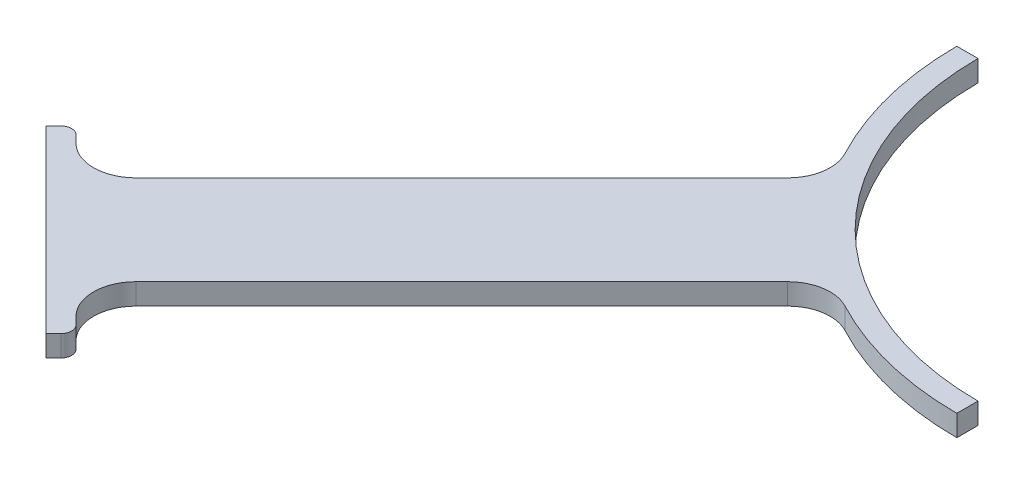
ISO-10303-21;
HEADER;
FILE_DESCRIPTION(('STEP AP214'),'2;1');
FILE_NAME('part.step','',(''),(''),'','','');
FILE_SCHEMA(('AUTOMOTIVE_DESIGN { 1 0 10303 214 1 1 1 1 }'));
ENDSEC;
DATA;
#1=APPLICATION_CONTEXT('core data for automotive mechanical design processes');
#2=APPLICATION_PROTOCOL_DEFINITION('international standard','automotive_design',2000,#1);
#3=PRODUCT_CONTEXT('',#1,'mechanical');
#4=PRODUCT('Part','Part','',(#3));
#5=PRODUCT_RELATED_PRODUCT_CATEGORY('part','',(#4));
#6=PRODUCT_DEFINITION_FORMATION('','',#4);
#7=PRODUCT_DEFINITION_CONTEXT('part definition',#1,'design');
#8=PRODUCT_DEFINITION('design','',#6,#7);
#9=PRODUCT_DEFINITION_SHAPE('','',#8);
#10=(LENGTH_UNIT() NAMED_UNIT(*) SI_UNIT(.MILLI.,.METRE.));
#11=(NAMED_UNIT(*) PLANE_ANGLE_UNIT() SI_UNIT($,.RADIAN.));
#12=(NAMED_UNIT(*) SI_UNIT($,.STERADIAN.) SOLID_ANGLE_UNIT());
#13=UNCERTAINTY_MEASURE_WITH_UNIT(LENGTH_MEASURE(1.E-05),#10,'distance_accuracy_value','');
#14=(GEOMETRIC_REPRESENTATION_CONTEXT(3) GLOBAL_UNCERTAINTY_ASSIGNED_CONTEXT((#13)) GLOBAL_UNIT_ASSIGNED_CONTEXT((#10,
#11,#12)) REPRESENTATION_CONTEXT('',''));
#15=CARTESIAN_POINT('',(0.,0.,0.));
#16=DIRECTION('',(0.,0.,1.));
#17=DIRECTION('',(1.,0.,0.));
#18=AXIS2_PLACEMENT_3D('',#15,#16,#17);
#19=CARTESIAN_POINT('',(0.,5.,0.));
#20=DIRECTION('',(0.,0.,1.));
#21=DIRECTION('',(1.,0.,0.));
#22=AXIS2_PLACEMENT_3D('',#19,#20,#21);
#23=PLANE('',#22);
#24=DIRECTION('',(-1.,0.,0.));
#25=VECTOR('',#24,1.);
#26=CARTESIAN_POINT('',(0.,0.,0.));
#27=LINE('',#26,#25);
#28=CARTESIAN_POINT('',(-70.,0.,0.));
#29=VERTEX_POINT('',#28);
#30=CARTESIAN_POINT('',(-75.,0.,0.));
#31=VERTEX_POINT('',#30);
#32=EDGE_CURVE('E202',#29,#31,#27,.T.);
#33=ORIENTED_EDGE('',*,*,#32,.T.);
#34=DIRECTION('',(0.,-1.,0.));
#35=VECTOR('',#34,1.);
#36=CARTESIAN_POINT('',(-75.,5.,0.));
#37=LINE('',#36,#35);
#38=CARTESIAN_POINT('',(-75.,5.,0.));
#39=VERTEX_POINT('',#38);
#40=EDGE_CURVE('E180',#39,#31,#37,.T.);
#41=ORIENTED_EDGE('',*,*,#40,.F.);
#42=DIRECTION('',(-1.,0.,0.));
#43=VECTOR('',#42,1.);
#44=CARTESIAN_POINT('',(0.,5.,0.));
#45=LINE('',#44,#43);
#46=CARTESIAN_POINT('',(-70.,5.,0.));
#47=VERTEX_POINT('',#46);
#48=EDGE_CURVE('E187',#47,#39,#45,.T.);
#49=ORIENTED_EDGE('',*,*,#48,.F.);
#50=DIRECTION('',(0.,-1.,0.));
#51=VECTOR('',#50,1.);
#52=CARTESIAN_POINT('',(-70.,5.,0.));
#53=LINE('',#52,#51);
#54=EDGE_CURVE('E331',#47,#29,#53,.T.);
#55=ORIENTED_EDGE('',*,*,#54,.T.);
#56=EDGE_LOOP('',(#33,#41,#49,#55));
#57=FACE_BOUND('',#56,.T.);
#58=ADVANCED_FACE('F49',(#57),#23,.F.);
#59=CARTESIAN_POINT('',(0.,5.,0.));
#60=DIRECTION('',(0.,-1.,0.));
#61=DIRECTION('',(0.,0.,-1.));
#62=AXIS2_PLACEMENT_3D('',#59,#60,#61);
#63=CYLINDRICAL_SURFACE('',#62,75.);
#64=CARTESIAN_POINT('',(0.,0.,0.));
#65=DIRECTION('',(0.,1.,0.));
#66=DIRECTION('',(0.,0.,1.));
#67=AXIS2_PLACEMENT_3D('',#64,#65,#66);
#68=CIRCLE('',#67,75.);
#69=CARTESIAN_POINT('',(-66.2852611720978,0.,35.0893737668084));
#70=VERTEX_POINT('',#69);
#71=EDGE_CURVE('E380',#31,#70,#68,.T.);
#72=ORIENTED_EDGE('',*,*,#71,.T.);
#73=DIRECTION('',(0.,-1.,0.));
#74=VECTOR('',#73,1.);
#75=CARTESIAN_POINT('',(-66.2852611720978,5.,35.0893737668084));
#76=LINE('',#75,#74);
#77=CARTESIAN_POINT('',(-66.2852611720978,5.,35.0893737668084));
#78=VERTEX_POINT('',#77);
#79=EDGE_CURVE('E183',#70,#78,#76,.F.);
#80=ORIENTED_EDGE('',*,*,#79,.T.);
#81=CARTESIAN_POINT('',(0.,5.,0.));
#82=DIRECTION('',(0.,1.,0.));
#83=DIRECTION('',(0.,0.,1.));
#84=AXIS2_PLACEMENT_3D('',#81,#82,#83);
#85=CIRCLE('',#84,75.);
#86=EDGE_CURVE('E175',#39,#78,#85,.T.);
#87=ORIENTED_EDGE('',*,*,#86,.F.);
#88=ORIENTED_EDGE('',*,*,#40,.T.);
#89=EDGE_LOOP('',(#72,#80,#87,#88));
#90=FACE_BOUND('',#89,.T.);
#91=ADVANCED_FACE('F178',(#90),#63,.T.);
#92=CARTESIAN_POINT('',(-10.6066017177988,5.,-10.6066017177987));
#93=DIRECTION('',(-0.70710678118655,0.,-0.707106781186545));
#94=DIRECTION('',(-0.707106781186545,0.,0.70710678118655));
#95=AXIS2_PLACEMENT_3D('',#92,#93,#94);
#96=PLANE('',#95);
#97=DIRECTION('',(0.707106781186545,0.,-0.70710678118655));
#98=VECTOR('',#97,1.);
#99=CARTESIAN_POINT('',(-10.6066017177988,0.,-10.6066017177987));
#100=LINE('',#99,#98);
#101=CARTESIAN_POINT('',(-144.956890143242,0.,123.743686707646));
#102=VERTEX_POINT('',#101);
#103=CARTESIAN_POINT('',(-68.0522281831787,0.,46.8390247475817));
#104=VERTEX_POINT('',#103);
#105=EDGE_CURVE('E309',#102,#104,#100,.T.);
#106=ORIENTED_EDGE('',*,*,#105,.F.);
#107=DIRECTION('',(0.,-1.,0.));
#108=VECTOR('',#107,1.);
#109=CARTESIAN_POINT('',(-144.956890143242,5.,123.743686707646));
#110=LINE('',#109,#108);
#111=CARTESIAN_POINT('',(-144.956890143242,5.,123.743686707646));
#112=VERTEX_POINT('',#111);
#113=EDGE_CURVE('E232',#102,#112,#110,.F.);
#114=ORIENTED_EDGE('',*,*,#113,.T.);
#115=DIRECTION('',(0.707106781186545,0.,-0.70710678118655));
#116=VECTOR('',#115,1.);
#117=CARTESIAN_POINT('',(-10.6066017177988,5.,-10.6066017177987));
#118=LINE('',#117,#116);
#119=CARTESIAN_POINT('',(-68.0522281831787,5.,46.8390247475817));
#120=VERTEX_POINT('',#119);
#121=EDGE_CURVE('E186',#112,#120,#118,.T.);
#122=ORIENTED_EDGE('',*,*,#121,.T.);
#123=DIRECTION('',(0.,-1.,0.));
#124=VECTOR('',#123,1.);
#125=CARTESIAN_POINT('',(-68.0522281831787,5.,46.8390247475817));
#126=LINE('',#125,#124);
#127=EDGE_CURVE('E229',#120,#104,#126,.T.);
#128=ORIENTED_EDGE('',*,*,#127,.T.);
#129=EDGE_LOOP('',(#106,#114,#122,#128));
#130=FACE_BOUND('',#129,.T.);
#131=ADVANCED_FACE('F389',(#130),#96,.T.);
#132=CARTESIAN_POINT('',(-141.421356237309,5.,141.42135623731));
#133=DIRECTION('',(0.707106781186545,0.,-0.70710678118655));
#134=DIRECTION('',(-0.70710678118655,0.,-0.707106781186545));
#135=AXIS2_PLACEMENT_3D('',#132,#133,#134);
#136=PLANE('',#135);
#137=DIRECTION('',(0.70710678118655,0.,0.707106781186545));
#138=VECTOR('',#137,1.);
#139=CARTESIAN_POINT('',(-141.421356237309,0.,141.42135623731));
#140=LINE('',#139,#138);
#141=CARTESIAN_POINT('',(-160.866792719939,0.,121.975919754679));
#142=VERTEX_POINT('',#141);
#143=CARTESIAN_POINT('',(-159.099025766973,0.,123.743686707646));
#144=VERTEX_POINT('',#143);
#145=EDGE_CURVE('E303',#142,#144,#140,.T.);
#146=ORIENTED_EDGE('',*,*,#145,.F.);
#147=DIRECTION('',(0.,-1.,0.));
#148=VECTOR('',#147,1.);
#149=CARTESIAN_POINT('',(-160.866792719939,5.,121.975919754679));
#150=LINE('',#149,#148);
#151=CARTESIAN_POINT('',(-160.866792719939,5.,121.975919754679));
#152=VERTEX_POINT('',#151);
#153=EDGE_CURVE('E11',#142,#152,#150,.F.);
#154=ORIENTED_EDGE('',*,*,#153,.T.);
#155=DIRECTION('',(0.70710678118655,0.,0.707106781186545));
#156=VECTOR('',#155,1.);
#157=CARTESIAN_POINT('',(-141.421356237309,5.,141.42135623731));
#158=LINE('',#157,#156);
#159=CARTESIAN_POINT('',(-159.099025766973,5.,123.743686707646));
#160=VERTEX_POINT('',#159);
#161=EDGE_CURVE('E354',#152,#160,#158,.T.);
#162=ORIENTED_EDGE('',*,*,#161,.T.);
#163=DIRECTION('',(0.,-1.,0.));
#164=VECTOR('',#163,1.);
#165=CARTESIAN_POINT('',(-159.099025766973,0.,123.743686707646));
#166=LINE('',#165,#164);
#167=EDGE_CURVE('E225',#160,#144,#166,.T.);
#168=ORIENTED_EDGE('',*,*,#167,.T.);
#169=EDGE_LOOP('',(#146,#154,#162,#168));
#170=FACE_BOUND('',#169,.T.);
#171=ADVANCED_FACE('F556',(#170),#136,.T.);
#172=CARTESIAN_POINT('',(-21.2132034355967,5.,-21.2132034355966));
#173=DIRECTION('',(-0.707106781186549,0.,-0.707106781186546));
#174=DIRECTION('',(-0.707106781186546,0.,0.707106781186549));
#175=AXIS2_PLACEMENT_3D('',#172,#173,#174);
#176=PLANE('',#175);
#177=DIRECTION('',(0.707106781186546,0.,-0.707106781186549));
#178=VECTOR('',#177,1.);
#179=CARTESIAN_POINT('',(-21.2132034355967,5.,-21.2132034355966));
#180=LINE('',#179,#178);
#181=CARTESIAN_POINT('',(-166.170093578839,5.,123.743686707646));
#182=VERTEX_POINT('',#181);
#183=CARTESIAN_POINT('',(-164.402326625872,5.,121.975919754679));
#184=VERTEX_POINT('',#183);
#185=EDGE_CURVE('E294',#182,#184,#180,.T.);
#186=ORIENTED_EDGE('',*,*,#185,.T.);
#187=DIRECTION('',(0.,-1.,0.));
#188=VECTOR('',#187,1.);
#189=CARTESIAN_POINT('',(-164.402326625872,5.,121.975919754679));
#190=LINE('',#189,#188);
#191=CARTESIAN_POINT('',(-164.402326625872,0.,121.975919754679));
#192=VERTEX_POINT('',#191);
#193=EDGE_CURVE('E58',#184,#192,#190,.T.);
#194=ORIENTED_EDGE('',*,*,#193,.T.);
#195=DIRECTION('',(0.707106781186546,0.,-0.707106781186549));
#196=VECTOR('',#195,1.);
#197=CARTESIAN_POINT('',(-21.2132034355967,0.,-21.2132034355966));
#198=LINE('',#197,#196);
#199=CARTESIAN_POINT('',(-166.170093578839,0.,123.743686707646));
#200=VERTEX_POINT('',#199);
#201=EDGE_CURVE('E292',#200,#192,#198,.T.);
#202=ORIENTED_EDGE('',*,*,#201,.F.);
#203=DIRECTION('',(0.,-1.,0.));
#204=VECTOR('',#203,1.);
#205=CARTESIAN_POINT('',(-166.170093578839,5.,123.743686707646));
#206=LINE('',#205,#204);
#207=EDGE_CURVE('E205',#182,#200,#206,.T.);
#208=ORIENTED_EDGE('',*,*,#207,.F.);
#209=EDGE_LOOP('',(#186,#194,#202,#208));
#210=FACE_BOUND('',#209,.T.);
#211=ADVANCED_FACE('F291',(#210),#176,.T.);
#212=CARTESIAN_POINT('',(-144.956890143242,5.,144.956890143242));
#213=DIRECTION('',(-0.707106781186547,0.,0.707106781186548));
#214=DIRECTION('',(0.707106781186548,0.,0.707106781186547));
#215=AXIS2_PLACEMENT_3D('',#212,#213,#214);
#216=PLANE('',#215);
#217=DIRECTION('',(-0.707106781186548,0.,-0.707106781186547));
#218=VECTOR('',#217,1.);
#219=CARTESIAN_POINT('',(-144.956890143242,0.,144.956890143242));
#220=LINE('',#219,#218);
#221=CARTESIAN_POINT('',(-123.743686707646,0.,166.170093578839));
#222=VERTEX_POINT('',#221);
#223=EDGE_CURVE('E301',#222,#200,#220,.T.);
#224=ORIENTED_EDGE('',*,*,#223,.F.);
#225=DIRECTION('',(0.,-1.,0.));
#226=VECTOR('',#225,1.);
#227=CARTESIAN_POINT('',(-123.743686707646,5.,166.170093578839));
#228=LINE('',#227,#226);
#229=CARTESIAN_POINT('',(-123.743686707646,5.,166.170093578839));
#230=VERTEX_POINT('',#229);
#231=EDGE_CURVE('E214',#230,#222,#228,.T.);
#232=ORIENTED_EDGE('',*,*,#231,.F.);
#233=DIRECTION('',(-0.707106781186548,0.,-0.707106781186547));
#234=VECTOR('',#233,1.);
#235=CARTESIAN_POINT('',(-144.956890143242,5.,144.956890143242));
#236=LINE('',#235,#234);
#237=EDGE_CURVE('E353',#230,#182,#236,.T.);
#238=ORIENTED_EDGE('',*,*,#237,.T.);
#239=ORIENTED_EDGE('',*,*,#207,.T.);
#240=EDGE_LOOP('',(#224,#232,#238,#239));
#241=FACE_BOUND('',#240,.T.);
#242=ADVANCED_FACE('F352',(#241),#216,.T.);
#243=CARTESIAN_POINT('',(21.2132034355965,5.,21.2132034355965));
#244=DIRECTION('',(-0.707106781186548,0.,-0.707106781186548));
#245=DIRECTION('',(-0.707106781186548,0.,0.707106781186548));
#246=AXIS2_PLACEMENT_3D('',#243,#244,#245);
#247=PLANE('',#246);
#248=DIRECTION('',(0.707106781186548,0.,-0.707106781186548));
#249=VECTOR('',#248,1.);
#250=CARTESIAN_POINT('',(21.2132034355965,0.,21.2132034355965));
#251=LINE('',#250,#249);
#252=CARTESIAN_POINT('',(-121.975919754679,0.,164.402326625872));
#253=VERTEX_POINT('',#252);
#254=EDGE_CURVE('E307',#222,#253,#251,.T.);
#255=ORIENTED_EDGE('',*,*,#254,.T.);
#256=DIRECTION('',(0.,-1.,0.));
#257=VECTOR('',#256,1.);
#258=CARTESIAN_POINT('',(-121.975919754679,5.,164.402326625872));
#259=LINE('',#258,#257);
#260=CARTESIAN_POINT('',(-121.975919754679,5.,164.402326625872));
#261=VERTEX_POINT('',#260);
#262=EDGE_CURVE('E276',#253,#261,#259,.F.);
#263=ORIENTED_EDGE('',*,*,#262,.T.);
#264=DIRECTION('',(0.707106781186548,0.,-0.707106781186548));
#265=VECTOR('',#264,1.);
#266=CARTESIAN_POINT('',(21.2132034355965,5.,21.2132034355965));
#267=LINE('',#266,#265);
#268=EDGE_CURVE('E348',#230,#261,#267,.T.);
#269=ORIENTED_EDGE('',*,*,#268,.F.);
#270=ORIENTED_EDGE('',*,*,#231,.T.);
#271=EDGE_LOOP('',(#255,#263,#269,#270));
#272=FACE_BOUND('',#271,.T.);
#273=ADVANCED_FACE('F346',(#272),#247,.F.);
#274=CARTESIAN_POINT('',(-141.42135623731,5.,141.421356237309));
#275=DIRECTION('',(-0.707106781186549,0.,0.707106781186546));
#276=DIRECTION('',(0.707106781186546,0.,0.707106781186549));
#277=AXIS2_PLACEMENT_3D('',#274,#275,#276);
#278=PLANE('',#277);
#279=DIRECTION('',(-0.707106781186546,0.,-0.707106781186549));
#280=VECTOR('',#279,1.);
#281=CARTESIAN_POINT('',(-141.42135623731,5.,141.421356237309));
#282=LINE('',#281,#280);
#283=CARTESIAN_POINT('',(-121.975919754679,5.,160.86679271994));
#284=VERTEX_POINT('',#283);
#285=CARTESIAN_POINT('',(-123.743686707646,5.,159.099025766973));
#286=VERTEX_POINT('',#285);
#287=EDGE_CURVE('E365',#284,#286,#282,.T.);
#288=ORIENTED_EDGE('',*,*,#287,.F.);
#289=DIRECTION('',(0.,-1.,0.));
#290=VECTOR('',#289,1.);
#291=CARTESIAN_POINT('',(-121.975919754679,5.,160.86679271994));
#292=LINE('',#291,#290);
#293=CARTESIAN_POINT('',(-121.975919754679,0.,160.86679271994));
#294=VERTEX_POINT('',#293);
#295=EDGE_CURVE('E266',#284,#294,#292,.T.);
#296=ORIENTED_EDGE('',*,*,#295,.T.);
#297=DIRECTION('',(-0.707106781186546,0.,-0.707106781186549));
#298=VECTOR('',#297,1.);
#299=CARTESIAN_POINT('',(-141.42135623731,0.,141.421356237309));
#300=LINE('',#299,#298);
#301=CARTESIAN_POINT('',(-123.743686707646,0.,159.099025766973));
#302=VERTEX_POINT('',#301);
#303=EDGE_CURVE('E316',#294,#302,#300,.T.);
#304=ORIENTED_EDGE('',*,*,#303,.T.);
#305=DIRECTION('',(0.,-1.,0.));
#306=VECTOR('',#305,1.);
#307=CARTESIAN_POINT('',(-123.743686707646,5.,159.099025766973));
#308=LINE('',#307,#306);
#309=EDGE_CURVE('E221',#302,#286,#308,.F.);
#310=ORIENTED_EDGE('',*,*,#309,.T.);
#311=EDGE_LOOP('',(#288,#296,#304,#310));
#312=FACE_BOUND('',#311,.T.);
#313=ADVANCED_FACE('F496',(#312),#278,.F.);
#314=CARTESIAN_POINT('',(10.6066017177986,5.,10.6066017177986));
#315=DIRECTION('',(-0.707106781186546,0.,-0.707106781186549));
#316=DIRECTION('',(-0.707106781186549,0.,0.707106781186546));
#317=AXIS2_PLACEMENT_3D('',#314,#315,#316);
#318=PLANE('',#317);
#319=DIRECTION('',(0.707106781186549,0.,-0.707106781186546));
#320=VECTOR('',#319,1.);
#321=CARTESIAN_POINT('',(10.6066017177986,5.,10.6066017177986));
#322=LINE('',#321,#320);
#323=CARTESIAN_POINT('',(-123.743686707646,5.,144.956890143242));
#324=VERTEX_POINT('',#323);
#325=CARTESIAN_POINT('',(-46.8390247475818,5.,68.0522281831787));
#326=VERTEX_POINT('',#325);
#327=EDGE_CURVE('E368',#324,#326,#322,.T.);
#328=ORIENTED_EDGE('',*,*,#327,.F.);
#329=DIRECTION('',(0.,-1.,0.));
#330=VECTOR('',#329,1.);
#331=CARTESIAN_POINT('',(-123.743686707646,0.,144.956890143242));
#332=LINE('',#331,#330);
#333=CARTESIAN_POINT('',(-123.743686707646,0.,144.956890143242));
#334=VERTEX_POINT('',#333);
#335=EDGE_CURVE('E211',#324,#334,#332,.T.);
#336=ORIENTED_EDGE('',*,*,#335,.T.);
#337=DIRECTION('',(0.707106781186549,0.,-0.707106781186546));
#338=VECTOR('',#337,1.);
#339=CARTESIAN_POINT('',(10.6066017177986,0.,10.6066017177986));
#340=LINE('',#339,#338);
#341=CARTESIAN_POINT('',(-46.8390247475818,0.,68.0522281831787));
#342=VERTEX_POINT('',#341);
#343=EDGE_CURVE('E319',#334,#342,#340,.T.);
#344=ORIENTED_EDGE('',*,*,#343,.T.);
#345=DIRECTION('',(0.,1.,0.));
#346=VECTOR('',#345,1.);
#347=CARTESIAN_POINT('',(-46.8390247475818,5.,68.0522281831787));
#348=LINE('',#347,#346);
#349=EDGE_CURVE('E204',#342,#326,#348,.T.);
#350=ORIENTED_EDGE('',*,*,#349,.T.);
#351=EDGE_LOOP('',(#328,#336,#344,#350));
#352=FACE_BOUND('',#351,.T.);
#353=ADVANCED_FACE('F492',(#352),#318,.F.);
#354=CARTESIAN_POINT('',(-35.0893737668085,5.,66.2852611720978));
#355=VERTEX_POINT('',#354);
#356=CARTESIAN_POINT('',(0.,5.,75.));
#357=VERTEX_POINT('',#356);
#358=EDGE_CURVE('E189',#355,#357,#85,.T.);
#359=ORIENTED_EDGE('',*,*,#358,.F.);
#360=DIRECTION('',(0.,-1.,0.));
#361=VECTOR('',#360,1.);
#362=CARTESIAN_POINT('',(-35.0893737668085,5.,66.2852611720978));
#363=LINE('',#362,#361);
#364=CARTESIAN_POINT('',(-35.0893737668085,0.,66.2852611720978));
#365=VERTEX_POINT('',#364);
#366=EDGE_CURVE('E237',#355,#365,#363,.T.);
#367=ORIENTED_EDGE('',*,*,#366,.T.);
#368=CARTESIAN_POINT('',(0.,0.,75.));
#369=VERTEX_POINT('',#368);
#370=EDGE_CURVE('E323',#365,#369,#68,.T.);
#371=ORIENTED_EDGE('',*,*,#370,.T.);
#372=DIRECTION('',(0.,-1.,0.));
#373=VECTOR('',#372,1.);
#374=CARTESIAN_POINT('',(0.,5.,75.));
#375=LINE('',#374,#373);
#376=EDGE_CURVE('E337',#357,#369,#375,.T.);
#377=ORIENTED_EDGE('',*,*,#376,.F.);
#378=EDGE_LOOP('',(#359,#367,#371,#377));
#379=FACE_BOUND('',#378,.T.);
#380=ADVANCED_FACE('F452',(#379),#63,.T.);
#381=CARTESIAN_POINT('',(0.,5.,0.));
#382=DIRECTION('',(1.,0.,0.));
#383=DIRECTION('',(0.,0.,-1.));
#384=AXIS2_PLACEMENT_3D('',#381,#382,#383);
#385=PLANE('',#384);
#386=DIRECTION('',(0.,0.,1.));
#387=VECTOR('',#386,1.);
#388=CARTESIAN_POINT('',(0.,0.,0.));
#389=LINE('',#388,#387);
#390=CARTESIAN_POINT('',(0.,0.,70.));
#391=VERTEX_POINT('',#390);
#392=EDGE_CURVE('E324',#391,#369,#389,.T.);
#393=ORIENTED_EDGE('',*,*,#392,.F.);
#394=DIRECTION('',(0.,-1.,0.));
#395=VECTOR('',#394,1.);
#396=CARTESIAN_POINT('',(0.,5.,70.));
#397=LINE('',#396,#395);
#398=CARTESIAN_POINT('',(0.,5.,70.));
#399=VERTEX_POINT('',#398);
#400=EDGE_CURVE('E334',#399,#391,#397,.T.);
#401=ORIENTED_EDGE('',*,*,#400,.F.);
#402=DIRECTION('',(0.,0.,1.));
#403=VECTOR('',#402,1.);
#404=CARTESIAN_POINT('',(0.,5.,0.));
#405=LINE('',#404,#403);
#406=EDGE_CURVE('E372',#399,#357,#405,.T.);
#407=ORIENTED_EDGE('',*,*,#406,.T.);
#408=ORIENTED_EDGE('',*,*,#376,.T.);
#409=EDGE_LOOP('',(#393,#401,#407,#408));
#410=FACE_BOUND('',#409,.T.);
#411=ADVANCED_FACE('F456',(#410),#385,.T.);
#412=CARTESIAN_POINT('',(0.,5.,0.));
#413=DIRECTION('',(0.,-1.,0.));
#414=DIRECTION('',(0.,0.,-1.));
#415=AXIS2_PLACEMENT_3D('',#412,#413,#414);
#416=CYLINDRICAL_SURFACE('',#415,70.);
#417=CARTESIAN_POINT('',(0.,0.,0.));
#418=DIRECTION('',(0.,1.,0.));
#419=DIRECTION('',(0.,0.,1.));
#420=AXIS2_PLACEMENT_3D('',#417,#418,#419);
#421=CIRCLE('',#420,70.);
#422=EDGE_CURVE('E199',#29,#391,#421,.T.);
#423=ORIENTED_EDGE('',*,*,#422,.F.);
#424=ORIENTED_EDGE('',*,*,#54,.F.);
#425=CARTESIAN_POINT('',(0.,5.,0.));
#426=DIRECTION('',(0.,1.,0.));
#427=DIRECTION('',(0.,0.,1.));
#428=AXIS2_PLACEMENT_3D('',#425,#426,#427);
#429=CIRCLE('',#428,70.);
#430=EDGE_CURVE('E196',#47,#399,#429,.T.);
#431=ORIENTED_EDGE('',*,*,#430,.T.);
#432=ORIENTED_EDGE('',*,*,#400,.T.);
#433=EDGE_LOOP('',(#423,#424,#431,#432));
#434=FACE_BOUND('',#433,.T.);
#435=ADVANCED_FACE('F459',(#434),#416,.F.);
#436=CARTESIAN_POINT('',(0.,5.,0.));
#437=DIRECTION('',(0.,1.,0.));
#438=DIRECTION('',(0.,0.,1.));
#439=AXIS2_PLACEMENT_3D('',#436,#437,#438);
#440=PLANE('',#439);
#441=ORIENTED_EDGE('',*,*,#268,.T.);
#442=CARTESIAN_POINT('',(-123.743686707646,5.,162.634559672906));
#443=DIRECTION('',(0.,1.,0.));
#444=DIRECTION('',(0.,0.,1.));
#445=AXIS2_PLACEMENT_3D('',#442,#443,#444);
#446=CIRCLE('',#445,2.5);
#447=EDGE_CURVE('E281',#261,#284,#446,.T.);
#448=ORIENTED_EDGE('',*,*,#447,.T.);
#449=ORIENTED_EDGE('',*,*,#287,.T.);
#450=CARTESIAN_POINT('',(-116.67261889578,5.,152.027957955108));
#451=DIRECTION('',(0.,1.,0.));
#452=DIRECTION('',(0.,0.,1.));
#453=AXIS2_PLACEMENT_3D('',#450,#451,#452);
#454=CIRCLE('',#453,10.);
#455=EDGE_CURVE('E245',#286,#324,#454,.F.);
#456=ORIENTED_EDGE('',*,*,#455,.T.);
#457=ORIENTED_EDGE('',*,*,#327,.T.);
#458=CARTESIAN_POINT('',(-39.7679569357163,5.,75.1232959950442));
#459=DIRECTION('',(0.,1.,0.));
#460=DIRECTION('',(0.,0.,1.));
#461=AXIS2_PLACEMENT_3D('',#458,#459,#460);
#462=CIRCLE('',#461,10.);
#463=EDGE_CURVE('E263',#326,#355,#462,.F.);
#464=ORIENTED_EDGE('',*,*,#463,.T.);
#465=ORIENTED_EDGE('',*,*,#358,.T.);
#466=ORIENTED_EDGE('',*,*,#406,.F.);
#467=ORIENTED_EDGE('',*,*,#430,.F.);
#468=ORIENTED_EDGE('',*,*,#48,.T.);
#469=ORIENTED_EDGE('',*,*,#86,.T.);
#470=CARTESIAN_POINT('',(-75.1232959950442,5.,39.7679569357162));
#471=DIRECTION('',(0.,1.,0.));
#472=DIRECTION('',(0.,0.,1.));
#473=AXIS2_PLACEMENT_3D('',#470,#471,#472);
#474=CIRCLE('',#473,10.);
#475=EDGE_CURVE('E257',#78,#120,#474,.F.);
#476=ORIENTED_EDGE('',*,*,#475,.T.);
#477=ORIENTED_EDGE('',*,*,#121,.F.);
#478=CARTESIAN_POINT('',(-152.027957955108,5.,116.67261889578));
#479=DIRECTION('',(0.,1.,0.));
#480=DIRECTION('',(0.,0.,1.));
#481=AXIS2_PLACEMENT_3D('',#478,#479,#480);
#482=CIRCLE('',#481,10.);
#483=EDGE_CURVE('E250',#112,#160,#482,.F.);
#484=ORIENTED_EDGE('',*,*,#483,.T.);
#485=ORIENTED_EDGE('',*,*,#161,.F.);
#486=CARTESIAN_POINT('',(-162.634559672906,5.,123.743686707646));
#487=DIRECTION('',(0.,1.,0.));
#488=DIRECTION('',(0.,0.,1.));
#489=AXIS2_PLACEMENT_3D('',#486,#487,#488);
#490=CIRCLE('',#489,2.5);
#491=EDGE_CURVE('E65',#152,#184,#490,.T.);
#492=ORIENTED_EDGE('',*,*,#491,.T.);
#493=ORIENTED_EDGE('',*,*,#185,.F.);
#494=ORIENTED_EDGE('',*,*,#237,.F.);
#495=EDGE_LOOP('',(#441,#448,#449,#456,#457,#464,#465,#466,#467,#468,#469,#476,#477,#484,#485,
#492,#493,#494));
#496=FACE_BOUND('',#495,.T.);
#497=ADVANCED_FACE('F193',(#496),#440,.T.);
#498=CARTESIAN_POINT('',(0.,0.,0.));
#499=DIRECTION('',(0.,1.,0.));
#500=DIRECTION('',(0.,0.,1.));
#501=AXIS2_PLACEMENT_3D('',#498,#499,#500);
#502=PLANE('',#501);
#503=ORIENTED_EDGE('',*,*,#303,.F.);
#504=CARTESIAN_POINT('',(-123.743686707646,0.,162.634559672906));
#505=DIRECTION('',(0.,1.,0.));
#506=DIRECTION('',(0.,0.,1.));
#507=AXIS2_PLACEMENT_3D('',#504,#505,#506);
#508=CIRCLE('',#507,2.5);
#509=EDGE_CURVE('E273',#294,#253,#508,.F.);
#510=ORIENTED_EDGE('',*,*,#509,.T.);
#511=ORIENTED_EDGE('',*,*,#254,.F.);
#512=ORIENTED_EDGE('',*,*,#223,.T.);
#513=ORIENTED_EDGE('',*,*,#201,.T.);
#514=CARTESIAN_POINT('',(-162.634559672906,0.,123.743686707646));
#515=DIRECTION('',(0.,1.,0.));
#516=DIRECTION('',(0.,0.,1.));
#517=AXIS2_PLACEMENT_3D('',#514,#515,#516);
#518=CIRCLE('',#517,2.5);
#519=EDGE_CURVE('E270',#192,#142,#518,.F.);
#520=ORIENTED_EDGE('',*,*,#519,.T.);
#521=ORIENTED_EDGE('',*,*,#145,.T.);
#522=CARTESIAN_POINT('',(-152.027957955108,0.,116.67261889578));
#523=DIRECTION('',(0.,1.,0.));
#524=DIRECTION('',(0.,0.,1.));
#525=AXIS2_PLACEMENT_3D('',#522,#523,#524);
#526=CIRCLE('',#525,10.);
#527=EDGE_CURVE('E248',#144,#102,#526,.T.);
#528=ORIENTED_EDGE('',*,*,#527,.T.);
#529=ORIENTED_EDGE('',*,*,#105,.T.);
#530=CARTESIAN_POINT('',(-75.1232959950442,0.,39.7679569357162));
#531=DIRECTION('',(0.,1.,0.));
#532=DIRECTION('',(0.,0.,1.));
#533=AXIS2_PLACEMENT_3D('',#530,#531,#532);
#534=CIRCLE('',#533,10.);
#535=EDGE_CURVE('E254',#104,#70,#534,.T.);
#536=ORIENTED_EDGE('',*,*,#535,.T.);
#537=ORIENTED_EDGE('',*,*,#71,.F.);
#538=ORIENTED_EDGE('',*,*,#32,.F.);
#539=ORIENTED_EDGE('',*,*,#422,.T.);
#540=ORIENTED_EDGE('',*,*,#392,.T.);
#541=ORIENTED_EDGE('',*,*,#370,.F.);
#542=CARTESIAN_POINT('',(-39.7679569357163,0.,75.1232959950442));
#543=DIRECTION('',(0.,1.,0.));
#544=DIRECTION('',(0.,0.,1.));
#545=AXIS2_PLACEMENT_3D('',#542,#543,#544);
#546=CIRCLE('',#545,10.);
#547=EDGE_CURVE('E260',#365,#342,#546,.T.);
#548=ORIENTED_EDGE('',*,*,#547,.T.);
#549=ORIENTED_EDGE('',*,*,#343,.F.);
#550=CARTESIAN_POINT('',(-116.67261889578,0.,152.027957955108));
#551=DIRECTION('',(0.,1.,0.));
#552=DIRECTION('',(0.,0.,1.));
#553=AXIS2_PLACEMENT_3D('',#550,#551,#552);
#554=CIRCLE('',#553,10.);
#555=EDGE_CURVE('E241',#334,#302,#554,.T.);
#556=ORIENTED_EDGE('',*,*,#555,.T.);
#557=EDGE_LOOP('',(#503,#510,#511,#512,#513,#520,#521,#528,#529,#536,#537,#538,#539,#540,#541,
#548,#549,#556));
#558=FACE_BOUND('',#557,.T.);
#559=ADVANCED_FACE('F298',(#558),#502,.F.);
#560=CARTESIAN_POINT('',(-116.67261889578,5.,152.027957955108));
#561=DIRECTION('',(0.,1.,0.));
#562=DIRECTION('',(0.,0.,1.));
#563=AXIS2_PLACEMENT_3D('',#560,#561,#562);
#564=CYLINDRICAL_SURFACE('',#563,10.);
#565=ORIENTED_EDGE('',*,*,#455,.F.);
#566=ORIENTED_EDGE('',*,*,#309,.F.);
#567=ORIENTED_EDGE('',*,*,#555,.F.);
#568=ORIENTED_EDGE('',*,*,#335,.F.);
#569=EDGE_LOOP('',(#565,#566,#567,#568));
#570=FACE_BOUND('',#569,.T.);
#571=ADVANCED_FACE('F471',(#570),#564,.F.);
#572=CARTESIAN_POINT('',(-152.027957955108,5.,116.67261889578));
#573=DIRECTION('',(0.,1.,0.));
#574=DIRECTION('',(0.,0.,1.));
#575=AXIS2_PLACEMENT_3D('',#572,#573,#574);
#576=CYLINDRICAL_SURFACE('',#575,10.);
#577=ORIENTED_EDGE('',*,*,#483,.F.);
#578=ORIENTED_EDGE('',*,*,#113,.F.);
#579=ORIENTED_EDGE('',*,*,#527,.F.);
#580=ORIENTED_EDGE('',*,*,#167,.F.);
#581=EDGE_LOOP('',(#577,#578,#579,#580));
#582=FACE_BOUND('',#581,.T.);
#583=ADVANCED_FACE('F395',(#582),#576,.F.);
#584=CARTESIAN_POINT('',(-75.1232959950442,5.,39.7679569357162));
#585=DIRECTION('',(0.,-1.,0.));
#586=DIRECTION('',(0.,0.,-1.));
#587=AXIS2_PLACEMENT_3D('',#584,#585,#586);
#588=CYLINDRICAL_SURFACE('',#587,10.);
#589=ORIENTED_EDGE('',*,*,#475,.F.);
#590=ORIENTED_EDGE('',*,*,#79,.F.);
#591=ORIENTED_EDGE('',*,*,#535,.F.);
#592=ORIENTED_EDGE('',*,*,#127,.F.);
#593=EDGE_LOOP('',(#589,#590,#591,#592));
#594=FACE_BOUND('',#593,.T.);
#595=ADVANCED_FACE('F461',(#594),#588,.F.);
#596=CARTESIAN_POINT('',(-39.7679569357163,5.,75.1232959950442));
#597=DIRECTION('',(0.,-1.,0.));
#598=DIRECTION('',(0.,0.,-1.));
#599=AXIS2_PLACEMENT_3D('',#596,#597,#598);
#600=CYLINDRICAL_SURFACE('',#599,10.);
#601=ORIENTED_EDGE('',*,*,#463,.F.);
#602=ORIENTED_EDGE('',*,*,#349,.F.);
#603=ORIENTED_EDGE('',*,*,#547,.F.);
#604=ORIENTED_EDGE('',*,*,#366,.F.);
#605=EDGE_LOOP('',(#601,#602,#603,#604));
#606=FACE_BOUND('',#605,.T.);
#607=ADVANCED_FACE('F463',(#606),#600,.F.);
#608=CARTESIAN_POINT('',(-123.743686707646,5.,162.634559672906));
#609=DIRECTION('',(0.,-1.,0.));
#610=DIRECTION('',(0.,0.,-1.));
#611=AXIS2_PLACEMENT_3D('',#608,#609,#610);
#612=CYLINDRICAL_SURFACE('',#611,2.5);
#613=ORIENTED_EDGE('',*,*,#447,.F.);
#614=ORIENTED_EDGE('',*,*,#262,.F.);
#615=ORIENTED_EDGE('',*,*,#509,.F.);
#616=ORIENTED_EDGE('',*,*,#295,.F.);
#617=EDGE_LOOP('',(#613,#614,#615,#616));
#618=FACE_BOUND('',#617,.T.);
#619=ADVANCED_FACE('F468',(#618),#612,.T.);
#620=CARTESIAN_POINT('',(-162.634559672906,5.,123.743686707646));
#621=DIRECTION('',(0.,-1.,0.));
#622=DIRECTION('',(0.,0.,-1.));
#623=AXIS2_PLACEMENT_3D('',#620,#621,#622);
#624=CYLINDRICAL_SURFACE('',#623,2.5);
#625=ORIENTED_EDGE('',*,*,#491,.F.);
#626=ORIENTED_EDGE('',*,*,#153,.F.);
#627=ORIENTED_EDGE('',*,*,#519,.F.);
#628=ORIENTED_EDGE('',*,*,#193,.F.);
#629=EDGE_LOOP('',(#625,#626,#627,#628));
#630=FACE_BOUND('',#629,.T.);
#631=ADVANCED_FACE('F51',(#630),#624,.T.);
#632=CLOSED_SHELL('',(#58,#91,#131,#171,#211,#242,#273,#313,#353,#380,#411,#435,#497,#559,#571,
#583,#595,#607,#619,#631));
#633=MANIFOLD_SOLID_BREP('B2',#632);
#634=ADVANCED_BREP_SHAPE_REPRESENTATION('',(#18,#633),#14);
#635=SHAPE_DEFINITION_REPRESENTATION(#9,#634);
ENDSEC;
END-ISO-10303-21;
